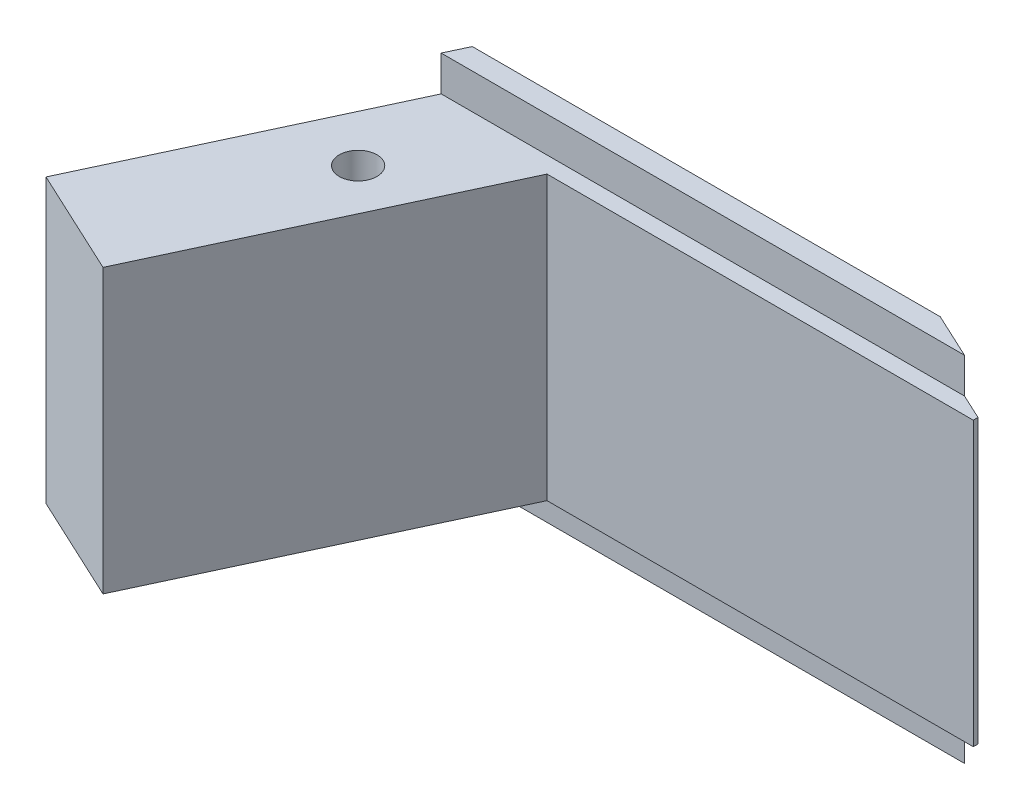
ISO-10303-21;
HEADER;
FILE_DESCRIPTION(('STEP AP214'),'2;1');
FILE_NAME('part.step','',(''),(''),'','','');
FILE_SCHEMA(('AUTOMOTIVE_DESIGN { 1 0 10303 214 1 1 1 1 }'));
ENDSEC;
DATA;
#1=APPLICATION_CONTEXT('core data for automotive mechanical design processes');
#2=APPLICATION_PROTOCOL_DEFINITION('international standard','automotive_design',2000,#1);
#3=PRODUCT_CONTEXT('',#1,'mechanical');
#4=PRODUCT('Part','Part','',(#3));
#5=PRODUCT_RELATED_PRODUCT_CATEGORY('part','',(#4));
#6=PRODUCT_DEFINITION_FORMATION('','',#4);
#7=PRODUCT_DEFINITION_CONTEXT('part definition',#1,'design');
#8=PRODUCT_DEFINITION('design','',#6,#7);
#9=PRODUCT_DEFINITION_SHAPE('','',#8);
#10=(LENGTH_UNIT() NAMED_UNIT(*) SI_UNIT(.MILLI.,.METRE.));
#11=(NAMED_UNIT(*) PLANE_ANGLE_UNIT() SI_UNIT($,.RADIAN.));
#12=(NAMED_UNIT(*) SI_UNIT($,.STERADIAN.) SOLID_ANGLE_UNIT());
#13=UNCERTAINTY_MEASURE_WITH_UNIT(LENGTH_MEASURE(1.E-05),#10,'distance_accuracy_value','');
#14=(GEOMETRIC_REPRESENTATION_CONTEXT(3) GLOBAL_UNCERTAINTY_ASSIGNED_CONTEXT((#13)) GLOBAL_UNIT_ASSIGNED_CONTEXT((#10,
#11,#12)) REPRESENTATION_CONTEXT('',''));
#15=CARTESIAN_POINT('',(0.,0.,0.));
#16=DIRECTION('',(0.,0.,1.));
#17=DIRECTION('',(1.,0.,0.));
#18=AXIS2_PLACEMENT_3D('',#15,#16,#17);
#19=CARTESIAN_POINT('',(0.,0.,11.));
#20=DIRECTION('',(0.,1.,0.));
#21=DIRECTION('',(0.,0.,1.));
#22=AXIS2_PLACEMENT_3D('',#19,#20,#21);
#23=PLANE('',#22);
#24=DIRECTION('',(1.,0.,0.));
#25=VECTOR('',#24,1.);
#26=CARTESIAN_POINT('',(0.,0.,0.899999999999996));
#27=LINE('',#26,#25);
#28=CARTESIAN_POINT('',(3.72435668773629,0.,0.899999999999996));
#29=VERTEX_POINT('',#28);
#30=CARTESIAN_POINT('',(25.9277465397452,0.,0.9));
#31=VERTEX_POINT('',#30);
#32=EDGE_CURVE('E54',#29,#31,#27,.T.);
#33=ORIENTED_EDGE('',*,*,#32,.F.);
#34=DIRECTION('',(0.422618261740701,0.,-0.906307787036649));
#35=VECTOR('',#34,1.);
#36=CARTESIAN_POINT('',(-0.367046397479922,0.,9.67404223084029));
#37=LINE('',#36,#35);
#38=CARTESIAN_POINT('',(4.14403358007579,0.,0.));
#39=VERTEX_POINT('',#38);
#40=EDGE_CURVE('E189',#29,#39,#37,.T.);
#41=ORIENTED_EDGE('',*,*,#40,.T.);
#42=DIRECTION('',(1.,0.,0.));
#43=VECTOR('',#42,1.);
#44=CARTESIAN_POINT('',(0.,0.,0.));
#45=LINE('',#44,#43);
#46=CARTESIAN_POINT('',(23.9976903112866,0.,0.));
#47=VERTEX_POINT('',#46);
#48=EDGE_CURVE('E195',#39,#47,#45,.T.);
#49=ORIENTED_EDGE('',*,*,#48,.T.);
#50=DIRECTION('',(-0.90630778703665,0.,-0.4226182617407));
#51=VECTOR('',#50,1.);
#52=CARTESIAN_POINT('',(-1.2621526695141,0.,-11.7788582257402));
#53=LINE('',#52,#51);
#54=EDGE_CURVE('E173',#31,#47,#53,.T.);
#55=ORIENTED_EDGE('',*,*,#54,.F.);
#56=EDGE_LOOP('',(#33,#41,#49,#55));
#57=FACE_BOUND('',#56,.T.);
#58=ADVANCED_FACE('F33',(#57),#23,.F.);
#59=CARTESIAN_POINT('',(0.,15.,11.));
#60=DIRECTION('',(0.,-1.,0.));
#61=DIRECTION('',(0.,0.,-1.));
#62=AXIS2_PLACEMENT_3D('',#59,#60,#61);
#63=PLANE('',#62);
#64=DIRECTION('',(-1.,0.,0.));
#65=VECTOR('',#64,1.);
#66=CARTESIAN_POINT('',(0.,15.,0.899999999999996));
#67=LINE('',#66,#65);
#68=CARTESIAN_POINT('',(25.9277465397452,15.,0.899999999999996));
#69=VERTEX_POINT('',#68);
#70=CARTESIAN_POINT('',(3.72435668773629,15.,0.899999999999996));
#71=VERTEX_POINT('',#70);
#72=EDGE_CURVE('E153',#69,#71,#67,.T.);
#73=ORIENTED_EDGE('',*,*,#72,.F.);
#74=DIRECTION('',(-0.90630778703665,0.,-0.4226182617407));
#75=VECTOR('',#74,1.);
#76=CARTESIAN_POINT('',(-1.2621526695141,15.,-11.7788582257402));
#77=LINE('',#76,#75);
#78=CARTESIAN_POINT('',(23.9976903112866,15.,0.));
#79=VERTEX_POINT('',#78);
#80=EDGE_CURVE('E172',#69,#79,#77,.T.);
#81=ORIENTED_EDGE('',*,*,#80,.T.);
#82=DIRECTION('',(-1.,0.,0.));
#83=VECTOR('',#82,1.);
#84=CARTESIAN_POINT('',(0.,15.,0.));
#85=LINE('',#84,#83);
#86=CARTESIAN_POINT('',(4.14403358007579,15.,0.));
#87=VERTEX_POINT('',#86);
#88=EDGE_CURVE('E198',#79,#87,#85,.T.);
#89=ORIENTED_EDGE('',*,*,#88,.T.);
#90=DIRECTION('',(0.422618261740701,0.,-0.906307787036649));
#91=VECTOR('',#90,1.);
#92=CARTESIAN_POINT('',(-0.367046397479922,15.,9.67404223084029));
#93=LINE('',#92,#91);
#94=EDGE_CURVE('E186',#71,#87,#93,.T.);
#95=ORIENTED_EDGE('',*,*,#94,.F.);
#96=EDGE_LOOP('',(#73,#81,#89,#95));
#97=FACE_BOUND('',#96,.T.);
#98=ADVANCED_FACE('F215',(#97),#63,.F.);
#99=CARTESIAN_POINT('',(27.,0.,11.));
#100=DIRECTION('',(-1.,0.,0.));
#101=DIRECTION('',(0.,0.,1.));
#102=AXIS2_PLACEMENT_3D('',#99,#100,#101);
#103=PLANE('',#102);
#104=DIRECTION('',(0.,1.,0.));
#105=VECTOR('',#104,1.);
#106=CARTESIAN_POINT('',(27.,0.,1.6));
#107=LINE('',#106,#105);
#108=CARTESIAN_POINT('',(27.,1.5,1.6));
#109=VERTEX_POINT('',#108);
#110=CARTESIAN_POINT('',(27.,13.5,1.6));
#111=VERTEX_POINT('',#110);
#112=EDGE_CURVE('E183',#109,#111,#107,.T.);
#113=ORIENTED_EDGE('',*,*,#112,.F.);
#114=DIRECTION('',(0.,0.,-1.));
#115=VECTOR('',#114,1.);
#116=CARTESIAN_POINT('',(27.,1.5,11.));
#117=LINE('',#116,#115);
#118=CARTESIAN_POINT('',(27.,1.5,1.4));
#119=VERTEX_POINT('',#118);
#120=EDGE_CURVE('E121',#109,#119,#117,.T.);
#121=ORIENTED_EDGE('',*,*,#120,.T.);
#122=DIRECTION('',(0.,1.,0.));
#123=VECTOR('',#122,1.);
#124=CARTESIAN_POINT('',(27.,0.,1.4));
#125=LINE('',#124,#123);
#126=CARTESIAN_POINT('',(27.,13.5,1.4));
#127=VERTEX_POINT('',#126);
#128=EDGE_CURVE('E175',#119,#127,#125,.T.);
#129=ORIENTED_EDGE('',*,*,#128,.T.);
#130=DIRECTION('',(0.,0.,1.));
#131=VECTOR('',#130,1.);
#132=CARTESIAN_POINT('',(27.,13.5,11.));
#133=LINE('',#132,#131);
#134=EDGE_CURVE('E156',#127,#111,#133,.T.);
#135=ORIENTED_EDGE('',*,*,#134,.T.);
#136=EDGE_LOOP('',(#113,#121,#129,#135));
#137=FACE_BOUND('',#136,.T.);
#138=ADVANCED_FACE('F250',(#137),#103,.F.);
#139=CARTESIAN_POINT('',(0.,15.,0.));
#140=DIRECTION('',(0.,0.,-1.));
#141=DIRECTION('',(-1.,0.,0.));
#142=AXIS2_PLACEMENT_3D('',#139,#140,#141);
#143=PLANE('',#142);
#144=ORIENTED_EDGE('',*,*,#88,.F.);
#145=DIRECTION('',(0.,1.,0.));
#146=VECTOR('',#145,1.);
#147=CARTESIAN_POINT('',(23.9976903112866,0.,0.));
#148=LINE('',#147,#146);
#149=EDGE_CURVE('E177',#47,#79,#148,.T.);
#150=ORIENTED_EDGE('',*,*,#149,.F.);
#151=ORIENTED_EDGE('',*,*,#48,.F.);
#152=DIRECTION('',(0.,1.,0.));
#153=VECTOR('',#152,1.);
#154=CARTESIAN_POINT('',(4.14403358007579,0.,0.));
#155=LINE('',#154,#153);
#156=EDGE_CURVE('E191',#39,#87,#155,.T.);
#157=ORIENTED_EDGE('',*,*,#156,.T.);
#158=EDGE_LOOP('',(#144,#150,#151,#157));
#159=FACE_BOUND('',#158,.T.);
#160=ADVANCED_FACE('F222',(#159),#143,.T.);
#161=CARTESIAN_POINT('',(-0.367046397479922,0.,9.67404223084029));
#162=DIRECTION('',(0.906307787036649,0.,0.422618261740701));
#163=DIRECTION('',(0.422618261740701,0.,-0.906307787036649));
#164=AXIS2_PLACEMENT_3D('',#161,#162,#163);
#165=PLANE('',#164);
#166=DIRECTION('',(-0.422618261740701,0.,0.906307787036649));
#167=VECTOR('',#166,1.);
#168=CARTESIAN_POINT('',(-0.367046397479922,1.5,9.67404223084029));
#169=LINE('',#168,#167);
#170=CARTESIAN_POINT('',(3.72435668773629,1.5,0.899999999999997));
#171=VERTEX_POINT('',#170);
#172=CARTESIAN_POINT('',(-1.60758208951023,1.5,12.3343796075384));
#173=VERTEX_POINT('',#172);
#174=EDGE_CURVE('E136',#171,#173,#169,.T.);
#175=ORIENTED_EDGE('',*,*,#174,.T.);
#176=DIRECTION('',(0.,1.,0.));
#177=VECTOR('',#176,1.);
#178=CARTESIAN_POINT('',(-1.60758208951023,1.5,12.3343796075384));
#179=LINE('',#178,#177);
#180=CARTESIAN_POINT('',(-1.60758208951023,13.5,12.3343796075384));
#181=VERTEX_POINT('',#180);
#182=EDGE_CURVE('E129',#173,#181,#179,.T.);
#183=ORIENTED_EDGE('',*,*,#182,.T.);
#184=DIRECTION('',(0.422618261740701,0.,-0.906307787036649));
#185=VECTOR('',#184,1.);
#186=CARTESIAN_POINT('',(-0.367046397479922,13.5,9.67404223084029));
#187=LINE('',#186,#185);
#188=CARTESIAN_POINT('',(3.72435668773629,13.5,0.899999999999997));
#189=VERTEX_POINT('',#188);
#190=EDGE_CURVE('E114',#181,#189,#187,.T.);
#191=ORIENTED_EDGE('',*,*,#190,.T.);
#192=DIRECTION('',(0.,-1.,0.));
#193=VECTOR('',#192,1.);
#194=CARTESIAN_POINT('',(3.72435668773629,0.,0.899999999999996));
#195=LINE('',#194,#193);
#196=EDGE_CURVE('E154',#71,#189,#195,.T.);
#197=ORIENTED_EDGE('',*,*,#196,.F.);
#198=ORIENTED_EDGE('',*,*,#94,.T.);
#199=ORIENTED_EDGE('',*,*,#156,.F.);
#200=ORIENTED_EDGE('',*,*,#40,.F.);
#201=EDGE_CURVE('E151',#171,#29,#195,.T.);
#202=ORIENTED_EDGE('',*,*,#201,.F.);
#203=EDGE_LOOP('',(#175,#183,#191,#197,#198,#199,#200,#202));
#204=FACE_BOUND('',#203,.T.);
#205=ADVANCED_FACE('F134',(#204),#165,.F.);
#206=CARTESIAN_POINT('',(-9.31921873577919,0.,1.59999999999999));
#207=DIRECTION('',(0.,0.,-1.));
#208=DIRECTION('',(-1.,0.,0.));
#209=AXIS2_PLACEMENT_3D('',#206,#207,#208);
#210=PLANE('',#209);
#211=DIRECTION('',(0.,1.,0.));
#212=VECTOR('',#211,1.);
#213=CARTESIAN_POINT('',(8.91483092184025,0.,1.6));
#214=LINE('',#213,#212);
#215=CARTESIAN_POINT('',(8.91483092184025,1.5,1.6));
#216=VERTEX_POINT('',#215);
#217=CARTESIAN_POINT('',(8.91483092184025,13.5,1.6));
#218=VERTEX_POINT('',#217);
#219=EDGE_CURVE('E180',#216,#218,#214,.T.);
#220=ORIENTED_EDGE('',*,*,#219,.F.);
#221=DIRECTION('',(1.,0.,0.));
#222=VECTOR('',#221,1.);
#223=CARTESIAN_POINT('',(-9.31921873577919,1.5,1.59999999999999));
#224=LINE('',#223,#222);
#225=EDGE_CURVE('E165',#216,#109,#224,.T.);
#226=ORIENTED_EDGE('',*,*,#225,.T.);
#227=ORIENTED_EDGE('',*,*,#112,.T.);
#228=DIRECTION('',(-1.,0.,0.));
#229=VECTOR('',#228,1.);
#230=CARTESIAN_POINT('',(-9.31921873577919,13.5,1.59999999999999));
#231=LINE('',#230,#229);
#232=EDGE_CURVE('E159',#111,#218,#231,.T.);
#233=ORIENTED_EDGE('',*,*,#232,.T.);
#234=EDGE_LOOP('',(#220,#226,#227,#233));
#235=FACE_BOUND('',#234,.T.);
#236=ADVANCED_FACE('F261',(#235),#210,.F.);
#237=CARTESIAN_POINT('',(4.16449253770333,0.,11.7871335395438));
#238=DIRECTION('',(-0.90630778703665,0.,-0.4226182617407));
#239=DIRECTION('',(-0.4226182617407,0.,0.90630778703665));
#240=AXIS2_PLACEMENT_3D('',#237,#238,#239);
#241=PLANE('',#240);
#242=DIRECTION('',(-0.4226182617407,0.,0.90630778703665));
#243=VECTOR('',#242,1.);
#244=CARTESIAN_POINT('',(4.16449253770333,13.5,11.7871335395438));
#245=LINE('',#244,#243);
#246=CARTESIAN_POINT('',(2.92395684567303,13.5,14.4474709162419));
#247=VERTEX_POINT('',#246);
#248=EDGE_CURVE('E122',#218,#247,#245,.T.);
#249=ORIENTED_EDGE('',*,*,#248,.T.);
#250=DIRECTION('',(0.,-1.,0.));
#251=VECTOR('',#250,1.);
#252=CARTESIAN_POINT('',(2.92395684567303,1.5,14.4474709162419));
#253=LINE('',#252,#251);
#254=CARTESIAN_POINT('',(2.92395684567303,1.5,14.4474709162419));
#255=VERTEX_POINT('',#254);
#256=EDGE_CURVE('E132',#247,#255,#253,.T.);
#257=ORIENTED_EDGE('',*,*,#256,.T.);
#258=DIRECTION('',(0.4226182617407,0.,-0.90630778703665));
#259=VECTOR('',#258,1.);
#260=CARTESIAN_POINT('',(4.16449253770333,1.5,11.7871335395438));
#261=LINE('',#260,#259);
#262=EDGE_CURVE('E168',#255,#216,#261,.T.);
#263=ORIENTED_EDGE('',*,*,#262,.T.);
#264=ORIENTED_EDGE('',*,*,#219,.T.);
#265=EDGE_LOOP('',(#249,#257,#263,#264));
#266=FACE_BOUND('',#265,.T.);
#267=ADVANCED_FACE('F264',(#266),#241,.F.);
#268=CARTESIAN_POINT('',(-1.2621526695141,0.,-11.7788582257402));
#269=DIRECTION('',(0.4226182617407,0.,-0.90630778703665));
#270=DIRECTION('',(-0.90630778703665,0.,-0.4226182617407));
#271=AXIS2_PLACEMENT_3D('',#268,#269,#270);
#272=PLANE('',#271);
#273=DIRECTION('',(-0.90630778703665,0.,-0.4226182617407));
#274=VECTOR('',#273,1.);
#275=CARTESIAN_POINT('',(-1.2621526695141,13.5,-11.7788582257402));
#276=LINE('',#275,#274);
#277=CARTESIAN_POINT('',(25.9277465397452,13.5,0.899999999999996));
#278=VERTEX_POINT('',#277);
#279=EDGE_CURVE('E13',#127,#278,#276,.T.);
#280=ORIENTED_EDGE('',*,*,#279,.F.);
#281=ORIENTED_EDGE('',*,*,#128,.F.);
#282=DIRECTION('',(0.90630778703665,0.,0.4226182617407));
#283=VECTOR('',#282,1.);
#284=CARTESIAN_POINT('',(-1.2621526695141,1.5,-11.7788582257402));
#285=LINE('',#284,#283);
#286=CARTESIAN_POINT('',(25.9277465397452,1.5,0.899999999999997));
#287=VERTEX_POINT('',#286);
#288=EDGE_CURVE('E202',#287,#119,#285,.T.);
#289=ORIENTED_EDGE('',*,*,#288,.F.);
#290=DIRECTION('',(0.,-1.,0.));
#291=VECTOR('',#290,1.);
#292=CARTESIAN_POINT('',(25.9277465397452,0.,0.899999999999996));
#293=LINE('',#292,#291);
#294=EDGE_CURVE('E201',#287,#31,#293,.T.);
#295=ORIENTED_EDGE('',*,*,#294,.T.);
#296=ORIENTED_EDGE('',*,*,#54,.T.);
#297=ORIENTED_EDGE('',*,*,#149,.T.);
#298=ORIENTED_EDGE('',*,*,#80,.F.);
#299=EDGE_CURVE('E40',#69,#278,#293,.T.);
#300=ORIENTED_EDGE('',*,*,#299,.T.);
#301=EDGE_LOOP('',(#280,#281,#289,#295,#296,#297,#298,#300));
#302=FACE_BOUND('',#301,.T.);
#303=ADVANCED_FACE('F209',(#302),#272,.T.);
#304=CARTESIAN_POINT('',(13.4595672449048,7.5,0.899999999999996));
#305=DIRECTION('',(0.,0.,1.));
#306=DIRECTION('',(1.,0.,0.));
#307=AXIS2_PLACEMENT_3D('',#304,#305,#306);
#308=PLANE('',#307);
#309=ORIENTED_EDGE('',*,*,#201,.T.);
#310=ORIENTED_EDGE('',*,*,#32,.T.);
#311=ORIENTED_EDGE('',*,*,#294,.F.);
#312=DIRECTION('',(1.,0.,0.));
#313=VECTOR('',#312,1.);
#314=CARTESIAN_POINT('',(-0.831288776929655,1.5,0.899999999999997));
#315=LINE('',#314,#313);
#316=EDGE_CURVE('E146',#171,#287,#315,.T.);
#317=ORIENTED_EDGE('',*,*,#316,.F.);
#318=EDGE_LOOP('',(#309,#310,#311,#317));
#319=FACE_BOUND('',#318,.T.);
#320=ADVANCED_FACE('F226',(#319),#308,.T.);
#321=CARTESIAN_POINT('',(-0.831288776929655,1.5,11.));
#322=DIRECTION('',(0.,1.,0.));
#323=DIRECTION('',(0.,0.,1.));
#324=AXIS2_PLACEMENT_3D('',#321,#322,#323);
#325=PLANE('',#324);
#326=CARTESIAN_POINT('',(4.59868576583168,1.5,5.29800856638312));
#327=DIRECTION('',(0.,1.,0.));
#328=DIRECTION('',(0.,0.,1.));
#329=AXIS2_PLACEMENT_3D('',#326,#327,#328);
#330=CIRCLE('',#329,0.8);
#331=CARTESIAN_POINT('',(4.59868576583168,1.5,6.09800856638312));
#332=VERTEX_POINT('',#331);
#333=EDGE_CURVE('E137',#332,#332,#330,.T.);
#334=ORIENTED_EDGE('',*,*,#333,.T.);
#335=EDGE_LOOP('',(#334));
#336=FACE_BOUND('',#335,.T.);
#337=ORIENTED_EDGE('',*,*,#316,.T.);
#338=ORIENTED_EDGE('',*,*,#288,.T.);
#339=ORIENTED_EDGE('',*,*,#120,.F.);
#340=ORIENTED_EDGE('',*,*,#225,.F.);
#341=ORIENTED_EDGE('',*,*,#262,.F.);
#342=DIRECTION('',(-0.90630778703665,0.,-0.4226182617407));
#343=VECTOR('',#342,1.);
#344=CARTESIAN_POINT('',(-1.60758208951024,1.5,12.3343796075384));
#345=LINE('',#344,#343);
#346=EDGE_CURVE('E144',#255,#173,#345,.T.);
#347=ORIENTED_EDGE('',*,*,#346,.T.);
#348=ORIENTED_EDGE('',*,*,#174,.F.);
#349=EDGE_LOOP('',(#337,#338,#339,#340,#341,#347,#348));
#350=FACE_BOUND('',#349,.T.);
#351=ADVANCED_FACE('F227',(#336,#350),#325,.F.);
#352=CARTESIAN_POINT('',(-0.831288776929656,13.5,11.));
#353=DIRECTION('',(0.,-1.,0.));
#354=DIRECTION('',(0.,0.,-1.));
#355=AXIS2_PLACEMENT_3D('',#352,#353,#354);
#356=PLANE('',#355);
#357=CARTESIAN_POINT('',(4.59868576583168,13.5,5.29800856638312));
#358=DIRECTION('',(0.,1.,0.));
#359=DIRECTION('',(0.,0.,1.));
#360=AXIS2_PLACEMENT_3D('',#357,#358,#359);
#361=CIRCLE('',#360,0.8);
#362=CARTESIAN_POINT('',(4.59868576583168,13.5,6.09800856638312));
#363=VERTEX_POINT('',#362);
#364=EDGE_CURVE('E140',#363,#363,#361,.T.);
#365=ORIENTED_EDGE('',*,*,#364,.F.);
#366=EDGE_LOOP('',(#365));
#367=FACE_BOUND('',#366,.T.);
#368=ORIENTED_EDGE('',*,*,#190,.F.);
#369=DIRECTION('',(0.90630778703665,0.,0.4226182617407));
#370=VECTOR('',#369,1.);
#371=CARTESIAN_POINT('',(2.92395684567302,13.5,14.4474709162419));
#372=LINE('',#371,#370);
#373=EDGE_CURVE('E117',#181,#247,#372,.T.);
#374=ORIENTED_EDGE('',*,*,#373,.T.);
#375=ORIENTED_EDGE('',*,*,#248,.F.);
#376=ORIENTED_EDGE('',*,*,#232,.F.);
#377=ORIENTED_EDGE('',*,*,#134,.F.);
#378=ORIENTED_EDGE('',*,*,#279,.T.);
#379=DIRECTION('',(-1.,0.,0.));
#380=VECTOR('',#379,1.);
#381=CARTESIAN_POINT('',(-0.831288776929656,13.5,0.899999999999997));
#382=LINE('',#381,#380);
#383=EDGE_CURVE('E47',#278,#189,#382,.T.);
#384=ORIENTED_EDGE('',*,*,#383,.T.);
#385=EDGE_LOOP('',(#368,#374,#375,#376,#377,#378,#384));
#386=FACE_BOUND('',#385,.T.);
#387=ADVANCED_FACE('F116',(#367,#386),#356,.F.);
#388=ORIENTED_EDGE('',*,*,#196,.T.);
#389=ORIENTED_EDGE('',*,*,#383,.F.);
#390=ORIENTED_EDGE('',*,*,#299,.F.);
#391=ORIENTED_EDGE('',*,*,#72,.T.);
#392=EDGE_LOOP('',(#388,#389,#390,#391));
#393=FACE_BOUND('',#392,.T.);
#394=ADVANCED_FACE('F212',(#393),#308,.T.);
#395=CARTESIAN_POINT('',(-10.5597544278095,0.,8.15991308906611));
#396=DIRECTION('',(0.4226182617407,0.,-0.90630778703665));
#397=DIRECTION('',(-0.90630778703665,0.,-0.4226182617407));
#398=AXIS2_PLACEMENT_3D('',#395,#396,#397);
#399=PLANE('',#398);
#400=ORIENTED_EDGE('',*,*,#256,.F.);
#401=ORIENTED_EDGE('',*,*,#373,.F.);
#402=ORIENTED_EDGE('',*,*,#182,.F.);
#403=ORIENTED_EDGE('',*,*,#346,.F.);
#404=EDGE_LOOP('',(#400,#401,#402,#403));
#405=FACE_BOUND('',#404,.T.);
#406=ADVANCED_FACE('F127',(#405),#399,.F.);
#407=CARTESIAN_POINT('',(4.59868576583168,0.,5.29800856638312));
#408=DIRECTION('',(0.,1.,0.));
#409=DIRECTION('',(0.,0.,1.));
#410=AXIS2_PLACEMENT_3D('',#407,#408,#409);
#411=CYLINDRICAL_SURFACE('',#410,0.8);
#412=ORIENTED_EDGE('',*,*,#364,.T.);
#413=EDGE_LOOP('',(#412));
#414=FACE_BOUND('',#413,.T.);
#415=ORIENTED_EDGE('',*,*,#333,.F.);
#416=EDGE_LOOP('',(#415));
#417=FACE_BOUND('',#416,.T.);
#418=ADVANCED_FACE('F233',(#414,#417),#411,.F.);
#419=CLOSED_SHELL('',(#58,#98,#138,#160,#205,#236,#267,#303,#320,#351,#387,#394,#406,#418));
#420=MANIFOLD_SOLID_BREP('B2',#419);
#421=ADVANCED_BREP_SHAPE_REPRESENTATION('',(#18,#420),#14);
#422=SHAPE_DEFINITION_REPRESENTATION(#9,#421);
ENDSEC;
END-ISO-10303-21;
